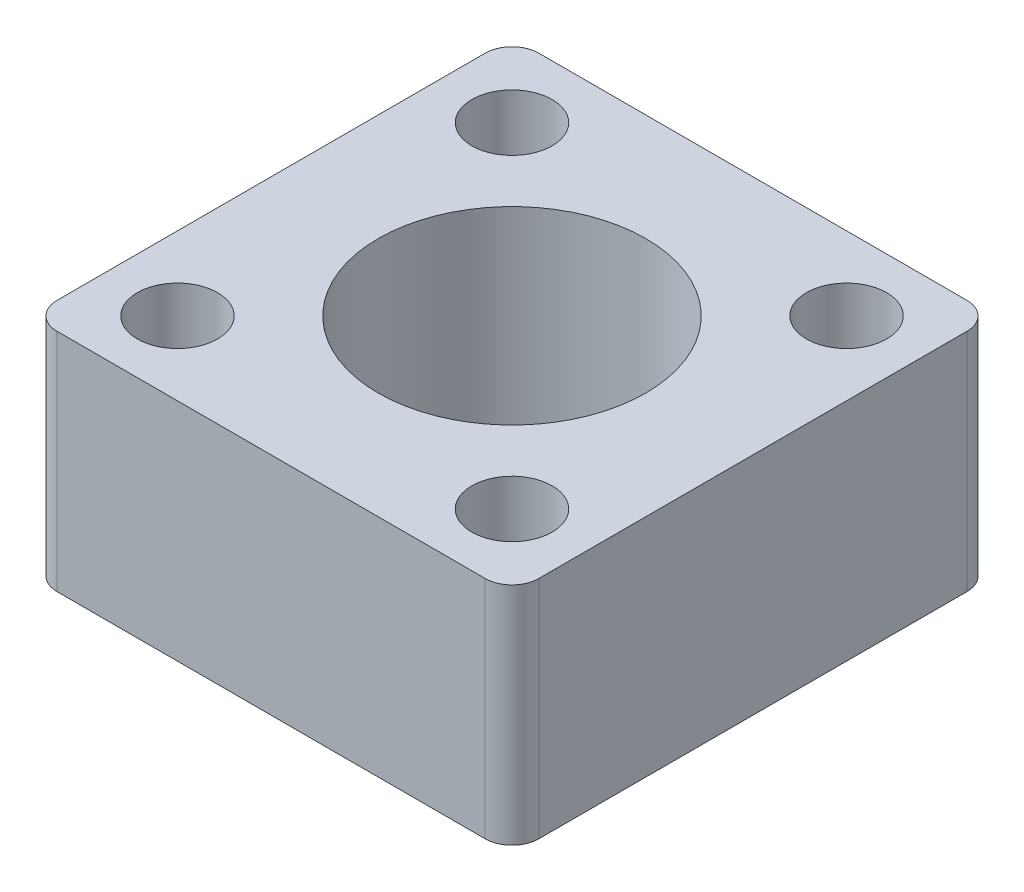
ISO-10303-21;
HEADER;
FILE_DESCRIPTION(('STEP AP214'),'2;1');
FILE_NAME('part.step','',(''),(''),'','','');
FILE_SCHEMA(('AUTOMOTIVE_DESIGN { 1 0 10303 214 1 1 1 1 }'));
ENDSEC;
DATA;
#1=APPLICATION_CONTEXT('core data for automotive mechanical design processes');
#2=APPLICATION_PROTOCOL_DEFINITION('international standard','automotive_design',2000,#1);
#3=PRODUCT_CONTEXT('',#1,'mechanical');
#4=PRODUCT('Part','Part','',(#3));
#5=PRODUCT_RELATED_PRODUCT_CATEGORY('part','',(#4));
#6=PRODUCT_DEFINITION_FORMATION('','',#4);
#7=PRODUCT_DEFINITION_CONTEXT('part definition',#1,'design');
#8=PRODUCT_DEFINITION('design','',#6,#7);
#9=PRODUCT_DEFINITION_SHAPE('','',#8);
#10=(LENGTH_UNIT() NAMED_UNIT(*) SI_UNIT(.MILLI.,.METRE.));
#11=(NAMED_UNIT(*) PLANE_ANGLE_UNIT() SI_UNIT($,.RADIAN.));
#12=(NAMED_UNIT(*) SI_UNIT($,.STERADIAN.) SOLID_ANGLE_UNIT());
#13=UNCERTAINTY_MEASURE_WITH_UNIT(LENGTH_MEASURE(1.E-05),#10,'distance_accuracy_value','');
#14=(GEOMETRIC_REPRESENTATION_CONTEXT(3) GLOBAL_UNCERTAINTY_ASSIGNED_CONTEXT((#13)) GLOBAL_UNIT_ASSIGNED_CONTEXT((#10,
#11,#12)) REPRESENTATION_CONTEXT('',''));
#15=CARTESIAN_POINT('',(0.,0.,0.));
#16=DIRECTION('',(0.,0.,1.));
#17=DIRECTION('',(1.,0.,0.));
#18=AXIS2_PLACEMENT_3D('',#15,#16,#17);
#19=CARTESIAN_POINT('',(18.,8.425,36.));
#20=DIRECTION('',(-1.,0.,0.));
#21=DIRECTION('',(0.,-1.,0.));
#22=AXIS2_PLACEMENT_3D('',#19,#20,#21);
#23=PLANE('',#22);
#24=DIRECTION('',(0.,0.,-1.));
#25=VECTOR('',#24,1.);
#26=CARTESIAN_POINT('',(18.,-8.425,36.));
#27=LINE('',#26,#25);
#28=CARTESIAN_POINT('',(18.,-8.425,34.));
#29=VERTEX_POINT('',#28);
#30=CARTESIAN_POINT('',(18.,-8.425,2.));
#31=VERTEX_POINT('',#30);
#32=EDGE_CURVE('E124',#29,#31,#27,.T.);
#33=ORIENTED_EDGE('',*,*,#32,.T.);
#34=DIRECTION('',(0.,1.,0.));
#35=VECTOR('',#34,1.);
#36=CARTESIAN_POINT('',(18.,8.425,2.));
#37=LINE('',#36,#35);
#38=CARTESIAN_POINT('',(18.,8.425,2.));
#39=VERTEX_POINT('',#38);
#40=EDGE_CURVE('E11',#31,#39,#37,.T.);
#41=ORIENTED_EDGE('',*,*,#40,.T.);
#42=DIRECTION('',(0.,0.,-1.));
#43=VECTOR('',#42,1.);
#44=CARTESIAN_POINT('',(18.,8.425,36.));
#45=LINE('',#44,#43);
#46=CARTESIAN_POINT('',(18.,8.425,34.));
#47=VERTEX_POINT('',#46);
#48=EDGE_CURVE('E116',#47,#39,#45,.T.);
#49=ORIENTED_EDGE('',*,*,#48,.F.);
#50=DIRECTION('',(0.,1.,0.));
#51=VECTOR('',#50,1.);
#52=CARTESIAN_POINT('',(18.,-8.425,34.));
#53=LINE('',#52,#51);
#54=EDGE_CURVE('E43',#47,#29,#53,.F.);
#55=ORIENTED_EDGE('',*,*,#54,.T.);
#56=EDGE_LOOP('',(#33,#41,#49,#55));
#57=FACE_BOUND('',#56,.T.);
#58=ADVANCED_FACE('F35',(#57),#23,.F.);
#59=CARTESIAN_POINT('',(-18.,8.425,36.));
#60=DIRECTION('',(0.,-1.,0.));
#61=DIRECTION('',(0.,0.,-1.));
#62=AXIS2_PLACEMENT_3D('',#59,#60,#61);
#63=PLANE('',#62);
#64=CARTESIAN_POINT('',(0.,8.425,18.));
#65=DIRECTION('',(0.,1.,0.));
#66=DIRECTION('',(0.,0.,1.));
#67=AXIS2_PLACEMENT_3D('',#64,#65,#66);
#68=CIRCLE('',#67,10.);
#69=CARTESIAN_POINT('',(0.,8.425,28.));
#70=VERTEX_POINT('',#69);
#71=EDGE_CURVE('E264',#70,#70,#68,.T.);
#72=ORIENTED_EDGE('',*,*,#71,.F.);
#73=EDGE_LOOP('',(#72));
#74=FACE_BOUND('',#73,.T.);
#75=CARTESIAN_POINT('',(12.5,8.425,5.50000000000001));
#76=DIRECTION('',(0.,1.,0.));
#77=DIRECTION('',(0.,0.,-1.));
#78=AXIS2_PLACEMENT_3D('',#75,#76,#77);
#79=CIRCLE('',#78,3.);
#80=CARTESIAN_POINT('',(12.5,8.425,2.50000000000001));
#81=VERTEX_POINT('',#80);
#82=EDGE_CURVE('E251',#81,#81,#79,.T.);
#83=ORIENTED_EDGE('',*,*,#82,.F.);
#84=EDGE_LOOP('',(#83));
#85=FACE_BOUND('',#84,.T.);
#86=CARTESIAN_POINT('',(12.5,8.425,30.5));
#87=DIRECTION('',(0.,1.,0.));
#88=DIRECTION('',(0.,0.,-1.));
#89=AXIS2_PLACEMENT_3D('',#86,#87,#88);
#90=CIRCLE('',#89,3.);
#91=CARTESIAN_POINT('',(12.5,8.425,27.5));
#92=VERTEX_POINT('',#91);
#93=EDGE_CURVE('E242',#92,#92,#90,.T.);
#94=ORIENTED_EDGE('',*,*,#93,.F.);
#95=EDGE_LOOP('',(#94));
#96=FACE_BOUND('',#95,.T.);
#97=CARTESIAN_POINT('',(-12.5,8.425,30.5));
#98=DIRECTION('',(0.,1.,0.));
#99=DIRECTION('',(0.,0.,1.));
#100=AXIS2_PLACEMENT_3D('',#97,#98,#99);
#101=CIRCLE('',#100,3.);
#102=CARTESIAN_POINT('',(-12.5,8.425,33.5));
#103=VERTEX_POINT('',#102);
#104=EDGE_CURVE('E236',#103,#103,#101,.T.);
#105=ORIENTED_EDGE('',*,*,#104,.F.);
#106=EDGE_LOOP('',(#105));
#107=FACE_BOUND('',#106,.T.);
#108=CARTESIAN_POINT('',(-12.5,8.425,5.50000000000001));
#109=DIRECTION('',(0.,1.,0.));
#110=DIRECTION('',(0.,0.,1.));
#111=AXIS2_PLACEMENT_3D('',#108,#109,#110);
#112=CIRCLE('',#111,3.);
#113=CARTESIAN_POINT('',(-12.5,8.425,8.50000000000001));
#114=VERTEX_POINT('',#113);
#115=EDGE_CURVE('E130',#114,#114,#112,.T.);
#116=ORIENTED_EDGE('',*,*,#115,.F.);
#117=EDGE_LOOP('',(#116));
#118=FACE_BOUND('',#117,.T.);
#119=DIRECTION('',(0.,0.,-1.));
#120=VECTOR('',#119,1.);
#121=CARTESIAN_POINT('',(-18.,8.425,36.));
#122=LINE('',#121,#120);
#123=CARTESIAN_POINT('',(-18.,8.425,34.));
#124=VERTEX_POINT('',#123);
#125=CARTESIAN_POINT('',(-18.,8.425,2.));
#126=VERTEX_POINT('',#125);
#127=EDGE_CURVE('E141',#124,#126,#122,.T.);
#128=ORIENTED_EDGE('',*,*,#127,.F.);
#129=CARTESIAN_POINT('',(-16.,8.425,34.));
#130=DIRECTION('',(0.,-1.,0.));
#131=DIRECTION('',(0.,0.,-1.));
#132=AXIS2_PLACEMENT_3D('',#129,#130,#131);
#133=CIRCLE('',#132,2.);
#134=CARTESIAN_POINT('',(-16.,8.425,36.));
#135=VERTEX_POINT('',#134);
#136=EDGE_CURVE('E121',#124,#135,#133,.F.);
#137=ORIENTED_EDGE('',*,*,#136,.T.);
#138=DIRECTION('',(-1.,0.,0.));
#139=VECTOR('',#138,1.);
#140=CARTESIAN_POINT('',(-18.,8.425,36.));
#141=LINE('',#140,#139);
#142=CARTESIAN_POINT('',(16.,8.425,36.));
#143=VERTEX_POINT('',#142);
#144=EDGE_CURVE('E111',#143,#135,#141,.T.);
#145=ORIENTED_EDGE('',*,*,#144,.F.);
#146=CARTESIAN_POINT('',(16.,8.425,34.));
#147=DIRECTION('',(0.,-1.,0.));
#148=DIRECTION('',(0.,0.,-1.));
#149=AXIS2_PLACEMENT_3D('',#146,#147,#148);
#150=CIRCLE('',#149,2.);
#151=EDGE_CURVE('E57',#143,#47,#150,.F.);
#152=ORIENTED_EDGE('',*,*,#151,.T.);
#153=ORIENTED_EDGE('',*,*,#48,.T.);
#154=CARTESIAN_POINT('',(16.,8.425,2.));
#155=DIRECTION('',(0.,-1.,0.));
#156=DIRECTION('',(0.,0.,-1.));
#157=AXIS2_PLACEMENT_3D('',#154,#155,#156);
#158=CIRCLE('',#157,2.);
#159=CARTESIAN_POINT('',(16.,8.425,0.));
#160=VERTEX_POINT('',#159);
#161=EDGE_CURVE('E50',#39,#160,#158,.F.);
#162=ORIENTED_EDGE('',*,*,#161,.T.);
#163=DIRECTION('',(-1.,0.,0.));
#164=VECTOR('',#163,1.);
#165=CARTESIAN_POINT('',(-18.,8.425,0.));
#166=LINE('',#165,#164);
#167=CARTESIAN_POINT('',(-16.,8.425,0.));
#168=VERTEX_POINT('',#167);
#169=EDGE_CURVE('E127',#160,#168,#166,.T.);
#170=ORIENTED_EDGE('',*,*,#169,.T.);
#171=CARTESIAN_POINT('',(-16.,8.425,2.));
#172=DIRECTION('',(0.,-1.,0.));
#173=DIRECTION('',(0.,0.,-1.));
#174=AXIS2_PLACEMENT_3D('',#171,#172,#173);
#175=CIRCLE('',#174,2.);
#176=EDGE_CURVE('E159',#168,#126,#175,.F.);
#177=ORIENTED_EDGE('',*,*,#176,.T.);
#178=EDGE_LOOP('',(#128,#137,#145,#152,#153,#162,#170,#177));
#179=FACE_BOUND('',#178,.T.);
#180=ADVANCED_FACE('F119',(#74,#85,#96,#107,#118,#179),#63,.F.);
#181=CARTESIAN_POINT('',(-18.,8.425,36.));
#182=DIRECTION('',(1.,0.,0.));
#183=DIRECTION('',(0.,1.,0.));
#184=AXIS2_PLACEMENT_3D('',#181,#182,#183);
#185=PLANE('',#184);
#186=DIRECTION('',(0.,0.,-1.));
#187=VECTOR('',#186,1.);
#188=CARTESIAN_POINT('',(-18.,-8.425,36.));
#189=LINE('',#188,#187);
#190=CARTESIAN_POINT('',(-18.,-8.425,34.));
#191=VERTEX_POINT('',#190);
#192=CARTESIAN_POINT('',(-18.,-8.425,2.));
#193=VERTEX_POINT('',#192);
#194=EDGE_CURVE('E138',#191,#193,#189,.T.);
#195=ORIENTED_EDGE('',*,*,#194,.F.);
#196=DIRECTION('',(0.,-1.,0.));
#197=VECTOR('',#196,1.);
#198=CARTESIAN_POINT('',(-18.,8.425,34.));
#199=LINE('',#198,#197);
#200=EDGE_CURVE('E104',#191,#124,#199,.F.);
#201=ORIENTED_EDGE('',*,*,#200,.T.);
#202=ORIENTED_EDGE('',*,*,#127,.T.);
#203=DIRECTION('',(0.,-1.,0.));
#204=VECTOR('',#203,1.);
#205=CARTESIAN_POINT('',(-18.,8.425,2.));
#206=LINE('',#205,#204);
#207=EDGE_CURVE('E154',#126,#193,#206,.T.);
#208=ORIENTED_EDGE('',*,*,#207,.T.);
#209=EDGE_LOOP('',(#195,#201,#202,#208));
#210=FACE_BOUND('',#209,.T.);
#211=ADVANCED_FACE('F182',(#210),#185,.F.);
#212=CARTESIAN_POINT('',(-18.,-8.425,36.));
#213=DIRECTION('',(0.,1.,0.));
#214=DIRECTION('',(0.,0.,1.));
#215=AXIS2_PLACEMENT_3D('',#212,#213,#214);
#216=PLANE('',#215);
#217=CARTESIAN_POINT('',(0.,-8.425,18.));
#218=DIRECTION('',(0.,1.,0.));
#219=DIRECTION('',(0.,0.,1.));
#220=AXIS2_PLACEMENT_3D('',#217,#218,#219);
#221=CIRCLE('',#220,10.);
#222=CARTESIAN_POINT('',(0.,-8.425,28.));
#223=VERTEX_POINT('',#222);
#224=EDGE_CURVE('E253',#223,#223,#221,.T.);
#225=ORIENTED_EDGE('',*,*,#224,.T.);
#226=EDGE_LOOP('',(#225));
#227=FACE_BOUND('',#226,.T.);
#228=CARTESIAN_POINT('',(12.5,-8.425,5.50000000000001));
#229=DIRECTION('',(0.,1.,0.));
#230=DIRECTION('',(0.,0.,-1.));
#231=AXIS2_PLACEMENT_3D('',#228,#229,#230);
#232=CIRCLE('',#231,3.);
#233=CARTESIAN_POINT('',(12.5,-8.425,2.50000000000001));
#234=VERTEX_POINT('',#233);
#235=EDGE_CURVE('E248',#234,#234,#232,.T.);
#236=ORIENTED_EDGE('',*,*,#235,.T.);
#237=EDGE_LOOP('',(#236));
#238=FACE_BOUND('',#237,.T.);
#239=CARTESIAN_POINT('',(12.5,-8.425,30.5));
#240=DIRECTION('',(0.,1.,0.));
#241=DIRECTION('',(0.,0.,-1.));
#242=AXIS2_PLACEMENT_3D('',#239,#240,#241);
#243=CIRCLE('',#242,3.);
#244=CARTESIAN_POINT('',(12.5,-8.425,27.5));
#245=VERTEX_POINT('',#244);
#246=EDGE_CURVE('E238',#245,#245,#243,.T.);
#247=ORIENTED_EDGE('',*,*,#246,.T.);
#248=EDGE_LOOP('',(#247));
#249=FACE_BOUND('',#248,.T.);
#250=CARTESIAN_POINT('',(-12.5,-8.425,30.5));
#251=DIRECTION('',(0.,1.,0.));
#252=DIRECTION('',(0.,0.,1.));
#253=AXIS2_PLACEMENT_3D('',#250,#251,#252);
#254=CIRCLE('',#253,3.);
#255=CARTESIAN_POINT('',(-12.5,-8.425,33.5));
#256=VERTEX_POINT('',#255);
#257=EDGE_CURVE('E233',#256,#256,#254,.T.);
#258=ORIENTED_EDGE('',*,*,#257,.T.);
#259=EDGE_LOOP('',(#258));
#260=FACE_BOUND('',#259,.T.);
#261=CARTESIAN_POINT('',(-12.5,-8.425,5.50000000000001));
#262=DIRECTION('',(0.,1.,0.));
#263=DIRECTION('',(0.,0.,1.));
#264=AXIS2_PLACEMENT_3D('',#261,#262,#263);
#265=CIRCLE('',#264,3.);
#266=CARTESIAN_POINT('',(-12.5,-8.425,8.50000000000001));
#267=VERTEX_POINT('',#266);
#268=EDGE_CURVE('E134',#267,#267,#265,.T.);
#269=ORIENTED_EDGE('',*,*,#268,.T.);
#270=EDGE_LOOP('',(#269));
#271=FACE_BOUND('',#270,.T.);
#272=DIRECTION('',(1.,0.,0.));
#273=VECTOR('',#272,1.);
#274=CARTESIAN_POINT('',(-18.,-8.425,36.));
#275=LINE('',#274,#273);
#276=CARTESIAN_POINT('',(-16.,-8.425,36.));
#277=VERTEX_POINT('',#276);
#278=CARTESIAN_POINT('',(16.,-8.425,36.));
#279=VERTEX_POINT('',#278);
#280=EDGE_CURVE('E114',#277,#279,#275,.T.);
#281=ORIENTED_EDGE('',*,*,#280,.F.);
#282=CARTESIAN_POINT('',(-16.,-8.425,34.));
#283=DIRECTION('',(0.,1.,0.));
#284=DIRECTION('',(0.,0.,1.));
#285=AXIS2_PLACEMENT_3D('',#282,#283,#284);
#286=CIRCLE('',#285,2.);
#287=EDGE_CURVE('E152',#277,#191,#286,.F.);
#288=ORIENTED_EDGE('',*,*,#287,.T.);
#289=ORIENTED_EDGE('',*,*,#194,.T.);
#290=CARTESIAN_POINT('',(-16.,-8.425,2.));
#291=DIRECTION('',(0.,1.,0.));
#292=DIRECTION('',(0.,0.,1.));
#293=AXIS2_PLACEMENT_3D('',#290,#291,#292);
#294=CIRCLE('',#293,2.);
#295=CARTESIAN_POINT('',(-16.,-8.425,0.));
#296=VERTEX_POINT('',#295);
#297=EDGE_CURVE('E150',#193,#296,#294,.F.);
#298=ORIENTED_EDGE('',*,*,#297,.T.);
#299=DIRECTION('',(1.,0.,0.));
#300=VECTOR('',#299,1.);
#301=CARTESIAN_POINT('',(-18.,-8.425,0.));
#302=LINE('',#301,#300);
#303=CARTESIAN_POINT('',(16.,-8.425,0.));
#304=VERTEX_POINT('',#303);
#305=EDGE_CURVE('E122',#296,#304,#302,.T.);
#306=ORIENTED_EDGE('',*,*,#305,.T.);
#307=CARTESIAN_POINT('',(16.,-8.425,2.));
#308=DIRECTION('',(0.,1.,0.));
#309=DIRECTION('',(0.,0.,1.));
#310=AXIS2_PLACEMENT_3D('',#307,#308,#309);
#311=CIRCLE('',#310,2.);
#312=EDGE_CURVE('E148',#304,#31,#311,.F.);
#313=ORIENTED_EDGE('',*,*,#312,.T.);
#314=ORIENTED_EDGE('',*,*,#32,.F.);
#315=CARTESIAN_POINT('',(16.,-8.425,34.));
#316=DIRECTION('',(0.,1.,0.));
#317=DIRECTION('',(0.,0.,1.));
#318=AXIS2_PLACEMENT_3D('',#315,#316,#317);
#319=CIRCLE('',#318,2.);
#320=EDGE_CURVE('E146',#29,#279,#319,.F.);
#321=ORIENTED_EDGE('',*,*,#320,.T.);
#322=EDGE_LOOP('',(#281,#288,#289,#298,#306,#313,#314,#321));
#323=FACE_BOUND('',#322,.T.);
#324=ADVANCED_FACE('F168',(#227,#238,#249,#260,#271,#323),#216,.F.);
#325=CARTESIAN_POINT('',(0.,0.,36.));
#326=DIRECTION('',(0.,0.,1.));
#327=DIRECTION('',(1.,0.,0.));
#328=AXIS2_PLACEMENT_3D('',#325,#326,#327);
#329=PLANE('',#328);
#330=ORIENTED_EDGE('',*,*,#144,.T.);
#331=DIRECTION('',(0.,-1.,0.));
#332=VECTOR('',#331,1.);
#333=CARTESIAN_POINT('',(-16.,-8.425,36.));
#334=LINE('',#333,#332);
#335=EDGE_CURVE('E115',#135,#277,#334,.T.);
#336=ORIENTED_EDGE('',*,*,#335,.T.);
#337=ORIENTED_EDGE('',*,*,#280,.T.);
#338=DIRECTION('',(0.,1.,0.));
#339=VECTOR('',#338,1.);
#340=CARTESIAN_POINT('',(16.,8.425,36.));
#341=LINE('',#340,#339);
#342=EDGE_CURVE('E103',#279,#143,#341,.T.);
#343=ORIENTED_EDGE('',*,*,#342,.T.);
#344=EDGE_LOOP('',(#330,#336,#337,#343));
#345=FACE_BOUND('',#344,.T.);
#346=ADVANCED_FACE('F109',(#345),#329,.T.);
#347=CARTESIAN_POINT('',(0.,0.,0.));
#348=DIRECTION('',(0.,0.,1.));
#349=DIRECTION('',(1.,0.,0.));
#350=AXIS2_PLACEMENT_3D('',#347,#348,#349);
#351=PLANE('',#350);
#352=ORIENTED_EDGE('',*,*,#305,.F.);
#353=DIRECTION('',(0.,-1.,0.));
#354=VECTOR('',#353,1.);
#355=CARTESIAN_POINT('',(-16.,0.,0.));
#356=LINE('',#355,#354);
#357=EDGE_CURVE('E164',#296,#168,#356,.F.);
#358=ORIENTED_EDGE('',*,*,#357,.T.);
#359=ORIENTED_EDGE('',*,*,#169,.F.);
#360=DIRECTION('',(0.,1.,0.));
#361=VECTOR('',#360,1.);
#362=CARTESIAN_POINT('',(16.,0.,0.));
#363=LINE('',#362,#361);
#364=EDGE_CURVE('E162',#160,#304,#363,.F.);
#365=ORIENTED_EDGE('',*,*,#364,.T.);
#366=EDGE_LOOP('',(#352,#358,#359,#365));
#367=FACE_BOUND('',#366,.T.);
#368=ADVANCED_FACE('F175',(#367),#351,.F.);
#369=CARTESIAN_POINT('',(-12.5,-8.425,5.50000000000001));
#370=DIRECTION('',(0.,1.,0.));
#371=DIRECTION('',(0.,0.,1.));
#372=AXIS2_PLACEMENT_3D('',#369,#370,#371);
#373=CYLINDRICAL_SURFACE('',#372,3.);
#374=ORIENTED_EDGE('',*,*,#268,.F.);
#375=EDGE_LOOP('',(#374));
#376=FACE_BOUND('',#375,.T.);
#377=ORIENTED_EDGE('',*,*,#115,.T.);
#378=EDGE_LOOP('',(#377));
#379=FACE_BOUND('',#378,.T.);
#380=ADVANCED_FACE('F212',(#376,#379),#373,.F.);
#381=CARTESIAN_POINT('',(-12.5,-8.425,30.5));
#382=DIRECTION('',(0.,1.,0.));
#383=DIRECTION('',(0.,0.,1.));
#384=AXIS2_PLACEMENT_3D('',#381,#382,#383);
#385=CYLINDRICAL_SURFACE('',#384,3.);
#386=ORIENTED_EDGE('',*,*,#257,.F.);
#387=EDGE_LOOP('',(#386));
#388=FACE_BOUND('',#387,.T.);
#389=ORIENTED_EDGE('',*,*,#104,.T.);
#390=EDGE_LOOP('',(#389));
#391=FACE_BOUND('',#390,.T.);
#392=ADVANCED_FACE('F217',(#388,#391),#385,.F.);
#393=CARTESIAN_POINT('',(12.5,-8.425,30.5));
#394=DIRECTION('',(0.,1.,0.));
#395=DIRECTION('',(0.,0.,1.));
#396=AXIS2_PLACEMENT_3D('',#393,#394,#395);
#397=CYLINDRICAL_SURFACE('',#396,3.);
#398=ORIENTED_EDGE('',*,*,#246,.F.);
#399=EDGE_LOOP('',(#398));
#400=FACE_BOUND('',#399,.T.);
#401=ORIENTED_EDGE('',*,*,#93,.T.);
#402=EDGE_LOOP('',(#401));
#403=FACE_BOUND('',#402,.T.);
#404=ADVANCED_FACE('F221',(#400,#403),#397,.F.);
#405=CARTESIAN_POINT('',(12.5,-8.425,5.50000000000001));
#406=DIRECTION('',(0.,1.,0.));
#407=DIRECTION('',(0.,0.,1.));
#408=AXIS2_PLACEMENT_3D('',#405,#406,#407);
#409=CYLINDRICAL_SURFACE('',#408,3.);
#410=ORIENTED_EDGE('',*,*,#235,.F.);
#411=EDGE_LOOP('',(#410));
#412=FACE_BOUND('',#411,.T.);
#413=ORIENTED_EDGE('',*,*,#82,.T.);
#414=EDGE_LOOP('',(#413));
#415=FACE_BOUND('',#414,.T.);
#416=ADVANCED_FACE('F194',(#412,#415),#409,.F.);
#417=CARTESIAN_POINT('',(0.,-8.425,18.));
#418=DIRECTION('',(0.,1.,0.));
#419=DIRECTION('',(0.,0.,1.));
#420=AXIS2_PLACEMENT_3D('',#417,#418,#419);
#421=CYLINDRICAL_SURFACE('',#420,10.);
#422=ORIENTED_EDGE('',*,*,#224,.F.);
#423=EDGE_LOOP('',(#422));
#424=FACE_BOUND('',#423,.T.);
#425=ORIENTED_EDGE('',*,*,#71,.T.);
#426=EDGE_LOOP('',(#425));
#427=FACE_BOUND('',#426,.T.);
#428=ADVANCED_FACE('F187',(#424,#427),#421,.F.);
#429=CARTESIAN_POINT('',(-16.,0.,34.));
#430=DIRECTION('',(0.,1.,0.));
#431=DIRECTION('',(-1.,0.,0.));
#432=AXIS2_PLACEMENT_3D('',#429,#430,#431);
#433=CYLINDRICAL_SURFACE('',#432,2.);
#434=ORIENTED_EDGE('',*,*,#136,.F.);
#435=ORIENTED_EDGE('',*,*,#200,.F.);
#436=ORIENTED_EDGE('',*,*,#287,.F.);
#437=ORIENTED_EDGE('',*,*,#335,.F.);
#438=EDGE_LOOP('',(#434,#435,#436,#437));
#439=FACE_BOUND('',#438,.T.);
#440=ADVANCED_FACE('F185',(#439),#433,.T.);
#441=CARTESIAN_POINT('',(-16.,8.425,2.));
#442=DIRECTION('',(0.,-1.,0.));
#443=DIRECTION('',(1.,0.,0.));
#444=AXIS2_PLACEMENT_3D('',#441,#442,#443);
#445=CYLINDRICAL_SURFACE('',#444,2.);
#446=ORIENTED_EDGE('',*,*,#176,.F.);
#447=ORIENTED_EDGE('',*,*,#357,.F.);
#448=ORIENTED_EDGE('',*,*,#297,.F.);
#449=ORIENTED_EDGE('',*,*,#207,.F.);
#450=EDGE_LOOP('',(#446,#447,#448,#449));
#451=FACE_BOUND('',#450,.T.);
#452=ADVANCED_FACE('F178',(#451),#445,.T.);
#453=CARTESIAN_POINT('',(16.,8.425,2.));
#454=DIRECTION('',(0.,1.,0.));
#455=DIRECTION('',(-1.,0.,0.));
#456=AXIS2_PLACEMENT_3D('',#453,#454,#455);
#457=CYLINDRICAL_SURFACE('',#456,2.);
#458=ORIENTED_EDGE('',*,*,#312,.F.);
#459=ORIENTED_EDGE('',*,*,#364,.F.);
#460=ORIENTED_EDGE('',*,*,#161,.F.);
#461=ORIENTED_EDGE('',*,*,#40,.F.);
#462=EDGE_LOOP('',(#458,#459,#460,#461));
#463=FACE_BOUND('',#462,.T.);
#464=ADVANCED_FACE('F171',(#463),#457,.T.);
#465=CARTESIAN_POINT('',(16.,0.,34.));
#466=DIRECTION('',(0.,-1.,0.));
#467=DIRECTION('',(1.,0.,0.));
#468=AXIS2_PLACEMENT_3D('',#465,#466,#467);
#469=CYLINDRICAL_SURFACE('',#468,2.);
#470=ORIENTED_EDGE('',*,*,#320,.F.);
#471=ORIENTED_EDGE('',*,*,#54,.F.);
#472=ORIENTED_EDGE('',*,*,#151,.F.);
#473=ORIENTED_EDGE('',*,*,#342,.F.);
#474=EDGE_LOOP('',(#470,#471,#472,#473));
#475=FACE_BOUND('',#474,.T.);
#476=ADVANCED_FACE('F37',(#475),#469,.T.);
#477=CLOSED_SHELL('',(#58,#180,#211,#324,#346,#368,#380,#392,#404,#416,#428,#440,#452,#464,#476));
#478=MANIFOLD_SOLID_BREP('B2',#477);
#479=ADVANCED_BREP_SHAPE_REPRESENTATION('',(#18,#478),#14);
#480=SHAPE_DEFINITION_REPRESENTATION(#9,#479);
ENDSEC;
END-ISO-10303-21;
